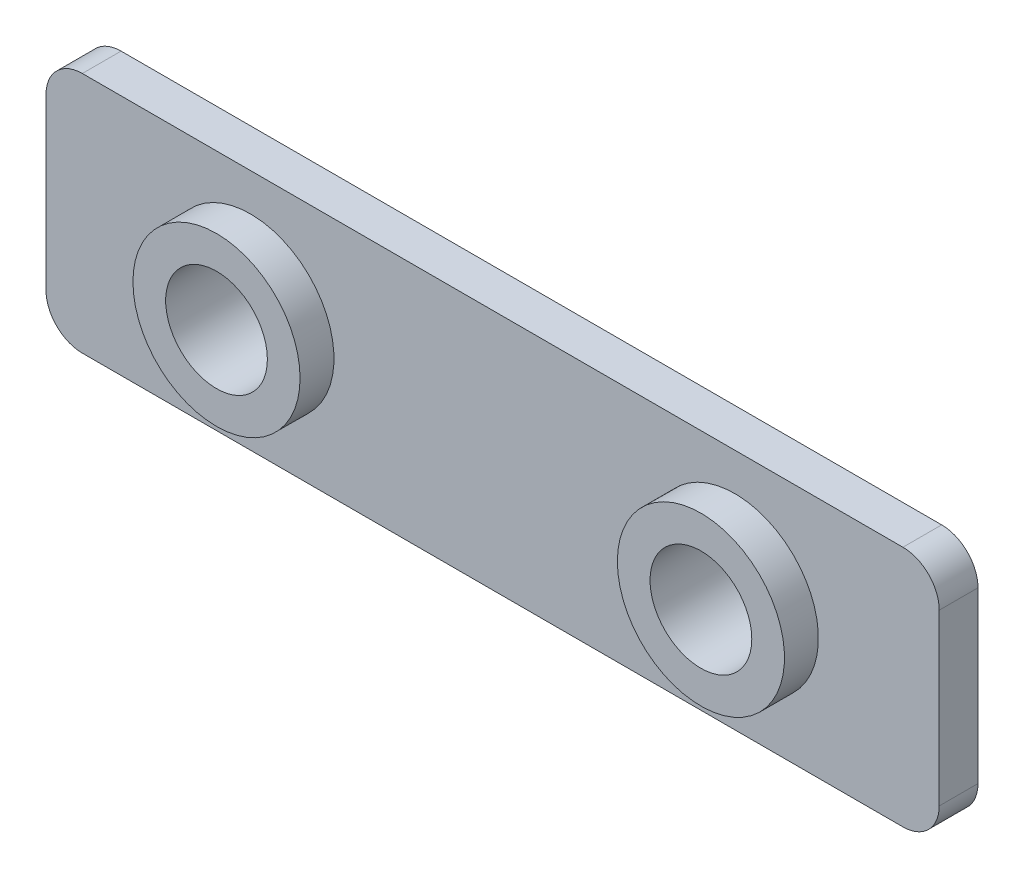
ISO-10303-21;
HEADER;
FILE_DESCRIPTION(('STEP AP214'),'2;1');
FILE_NAME('part.step','',(''),(''),'','','');
FILE_SCHEMA(('AUTOMOTIVE_DESIGN { 1 0 10303 214 1 1 1 1 }'));
ENDSEC;
DATA;
#1=APPLICATION_CONTEXT('core data for automotive mechanical design processes');
#2=APPLICATION_PROTOCOL_DEFINITION('international standard','automotive_design',2000,#1);
#3=PRODUCT_CONTEXT('',#1,'mechanical');
#4=PRODUCT('Part','Part','',(#3));
#5=PRODUCT_RELATED_PRODUCT_CATEGORY('part','',(#4));
#6=PRODUCT_DEFINITION_FORMATION('','',#4);
#7=PRODUCT_DEFINITION_CONTEXT('part definition',#1,'design');
#8=PRODUCT_DEFINITION('design','',#6,#7);
#9=PRODUCT_DEFINITION_SHAPE('','',#8);
#10=(LENGTH_UNIT() NAMED_UNIT(*) SI_UNIT(.MILLI.,.METRE.));
#11=(NAMED_UNIT(*) PLANE_ANGLE_UNIT() SI_UNIT($,.RADIAN.));
#12=(NAMED_UNIT(*) SI_UNIT($,.STERADIAN.) SOLID_ANGLE_UNIT());
#13=UNCERTAINTY_MEASURE_WITH_UNIT(LENGTH_MEASURE(1.E-05),#10,'distance_accuracy_value','');
#14=(GEOMETRIC_REPRESENTATION_CONTEXT(3) GLOBAL_UNCERTAINTY_ASSIGNED_CONTEXT((#13)) GLOBAL_UNIT_ASSIGNED_CONTEXT((#10,
#11,#12)) REPRESENTATION_CONTEXT('',''));
#15=CARTESIAN_POINT('',(0.,0.,0.));
#16=DIRECTION('',(0.,0.,1.));
#17=DIRECTION('',(1.,0.,0.));
#18=AXIS2_PLACEMENT_3D('',#15,#16,#17);
#19=CARTESIAN_POINT('',(35.38,8.5,1.6));
#20=DIRECTION('',(0.,0.,-1.));
#21=DIRECTION('',(-1.,0.,0.));
#22=AXIS2_PLACEMENT_3D('',#19,#20,#21);
#23=PLANE('',#22);
#24=CARTESIAN_POINT('',(8.44,5.,1.6));
#25=DIRECTION('',(0.,0.,-1.));
#26=DIRECTION('',(-1.,0.,0.));
#27=AXIS2_PLACEMENT_3D('',#24,#25,#26);
#28=CIRCLE('',#27,3.45);
#29=CARTESIAN_POINT('',(4.99,5.,1.6));
#30=VERTEX_POINT('',#29);
#31=EDGE_CURVE('E44',#30,#30,#28,.F.);
#32=ORIENTED_EDGE('',*,*,#31,.F.);
#33=EDGE_LOOP('',(#32));
#34=FACE_BOUND('',#33,.T.);
#35=CARTESIAN_POINT('',(35.38,8.5,1.6));
#36=DIRECTION('',(0.,0.,1.));
#37=DIRECTION('',(-1.,0.,0.));
#38=AXIS2_PLACEMENT_3D('',#35,#36,#37);
#39=CIRCLE('',#38,1.5);
#40=CARTESIAN_POINT('',(36.88,8.49999999999999,1.6));
#41=VERTEX_POINT('',#40);
#42=CARTESIAN_POINT('',(35.38,10.,1.6));
#43=VERTEX_POINT('',#42);
#44=EDGE_CURVE('E148',#41,#43,#39,.T.);
#45=ORIENTED_EDGE('',*,*,#44,.T.);
#46=DIRECTION('',(-1.,0.,0.));
#47=VECTOR('',#46,1.);
#48=CARTESIAN_POINT('',(1.50000000000001,10.,1.6));
#49=LINE('',#48,#47);
#50=CARTESIAN_POINT('',(1.50000000000001,10.,1.6));
#51=VERTEX_POINT('',#50);
#52=EDGE_CURVE('E96',#43,#51,#49,.T.);
#53=ORIENTED_EDGE('',*,*,#52,.T.);
#54=CARTESIAN_POINT('',(1.5,8.5,1.6));
#55=DIRECTION('',(0.,0.,1.));
#56=DIRECTION('',(-1.,0.,0.));
#57=AXIS2_PLACEMENT_3D('',#54,#55,#56);
#58=CIRCLE('',#57,1.5);
#59=CARTESIAN_POINT('',(0.,8.49999999999999,1.6));
#60=VERTEX_POINT('',#59);
#61=EDGE_CURVE('E208',#51,#60,#58,.T.);
#62=ORIENTED_EDGE('',*,*,#61,.T.);
#63=DIRECTION('',(0.,-1.,0.));
#64=VECTOR('',#63,1.);
#65=CARTESIAN_POINT('',(0.,1.50000000000001,1.6));
#66=LINE('',#65,#64);
#67=CARTESIAN_POINT('',(0.,1.50000000000001,1.6));
#68=VERTEX_POINT('',#67);
#69=EDGE_CURVE('E213',#60,#68,#66,.T.);
#70=ORIENTED_EDGE('',*,*,#69,.T.);
#71=CARTESIAN_POINT('',(1.5,1.5,1.6));
#72=DIRECTION('',(0.,0.,1.));
#73=DIRECTION('',(-1.,0.,0.));
#74=AXIS2_PLACEMENT_3D('',#71,#72,#73);
#75=CIRCLE('',#74,1.5);
#76=CARTESIAN_POINT('',(1.50000000000001,0.,1.6));
#77=VERTEX_POINT('',#76);
#78=EDGE_CURVE('E115',#68,#77,#75,.T.);
#79=ORIENTED_EDGE('',*,*,#78,.T.);
#80=DIRECTION('',(1.,0.,0.));
#81=VECTOR('',#80,1.);
#82=CARTESIAN_POINT('',(1.50000000000001,0.,1.6));
#83=LINE('',#82,#81);
#84=CARTESIAN_POINT('',(35.38,0.,1.6));
#85=VERTEX_POINT('',#84);
#86=EDGE_CURVE('E109',#77,#85,#83,.T.);
#87=ORIENTED_EDGE('',*,*,#86,.T.);
#88=CARTESIAN_POINT('',(35.38,1.5,1.6));
#89=DIRECTION('',(0.,0.,1.));
#90=DIRECTION('',(1.,0.,0.));
#91=AXIS2_PLACEMENT_3D('',#88,#89,#90);
#92=CIRCLE('',#91,1.5);
#93=CARTESIAN_POINT('',(36.88,1.50000000000001,1.6));
#94=VERTEX_POINT('',#93);
#95=EDGE_CURVE('E113',#85,#94,#92,.T.);
#96=ORIENTED_EDGE('',*,*,#95,.T.);
#97=DIRECTION('',(0.,1.,0.));
#98=VECTOR('',#97,1.);
#99=CARTESIAN_POINT('',(36.88,1.50000000000001,1.6));
#100=LINE('',#99,#98);
#101=EDGE_CURVE('E52',#94,#41,#100,.T.);
#102=ORIENTED_EDGE('',*,*,#101,.T.);
#103=EDGE_LOOP('',(#45,#53,#62,#70,#79,#87,#96,#102));
#104=FACE_BOUND('',#103,.T.);
#105=CARTESIAN_POINT('',(28.44,5.,1.6));
#106=DIRECTION('',(0.,0.,-1.));
#107=DIRECTION('',(-1.,0.,0.));
#108=AXIS2_PLACEMENT_3D('',#105,#106,#107);
#109=CIRCLE('',#108,3.45);
#110=CARTESIAN_POINT('',(24.99,5.,1.6));
#111=VERTEX_POINT('',#110);
#112=EDGE_CURVE('E11',#111,#111,#109,.F.);
#113=ORIENTED_EDGE('',*,*,#112,.F.);
#114=EDGE_LOOP('',(#113));
#115=FACE_BOUND('',#114,.T.);
#116=ADVANCED_FACE('F35',(#34,#104,#115),#23,.F.);
#117=CARTESIAN_POINT('',(35.38,8.5,1.6));
#118=DIRECTION('',(0.,0.,-1.));
#119=DIRECTION('',(-1.,0.,0.));
#120=AXIS2_PLACEMENT_3D('',#117,#118,#119);
#121=CYLINDRICAL_SURFACE('',#120,1.5);
#122=CARTESIAN_POINT('',(35.38,8.5,0.));
#123=DIRECTION('',(0.,0.,1.));
#124=DIRECTION('',(-1.,0.,0.));
#125=AXIS2_PLACEMENT_3D('',#122,#123,#124);
#126=CIRCLE('',#125,1.5);
#127=CARTESIAN_POINT('',(36.88,8.49999999999999,0.));
#128=VERTEX_POINT('',#127);
#129=CARTESIAN_POINT('',(35.38,10.,0.));
#130=VERTEX_POINT('',#129);
#131=EDGE_CURVE('E133',#128,#130,#126,.T.);
#132=ORIENTED_EDGE('',*,*,#131,.T.);
#133=DIRECTION('',(0.,0.,-1.));
#134=VECTOR('',#133,1.);
#135=CARTESIAN_POINT('',(35.38,10.,1.6));
#136=LINE('',#135,#134);
#137=EDGE_CURVE('E161',#43,#130,#136,.T.);
#138=ORIENTED_EDGE('',*,*,#137,.F.);
#139=ORIENTED_EDGE('',*,*,#44,.F.);
#140=DIRECTION('',(0.,0.,-1.));
#141=VECTOR('',#140,1.);
#142=CARTESIAN_POINT('',(36.88,8.49999999999999,1.6));
#143=LINE('',#142,#141);
#144=EDGE_CURVE('E129',#41,#128,#143,.T.);
#145=ORIENTED_EDGE('',*,*,#144,.T.);
#146=EDGE_LOOP('',(#132,#138,#139,#145));
#147=FACE_BOUND('',#146,.T.);
#148=ADVANCED_FACE('F37',(#147),#121,.T.);
#149=CARTESIAN_POINT('',(1.50000000000001,10.,1.6));
#150=DIRECTION('',(0.,-1.,0.));
#151=DIRECTION('',(0.,0.,-1.));
#152=AXIS2_PLACEMENT_3D('',#149,#150,#151);
#153=PLANE('',#152);
#154=DIRECTION('',(-1.,0.,0.));
#155=VECTOR('',#154,1.);
#156=CARTESIAN_POINT('',(1.50000000000001,10.,0.));
#157=LINE('',#156,#155);
#158=CARTESIAN_POINT('',(1.50000000000001,10.,0.));
#159=VERTEX_POINT('',#158);
#160=EDGE_CURVE('E136',#130,#159,#157,.T.);
#161=ORIENTED_EDGE('',*,*,#160,.T.);
#162=DIRECTION('',(0.,0.,-1.));
#163=VECTOR('',#162,1.);
#164=CARTESIAN_POINT('',(1.50000000000001,10.,1.6));
#165=LINE('',#164,#163);
#166=EDGE_CURVE('E158',#51,#159,#165,.T.);
#167=ORIENTED_EDGE('',*,*,#166,.F.);
#168=ORIENTED_EDGE('',*,*,#52,.F.);
#169=ORIENTED_EDGE('',*,*,#137,.T.);
#170=EDGE_LOOP('',(#161,#167,#168,#169));
#171=FACE_BOUND('',#170,.T.);
#172=ADVANCED_FACE('F172',(#171),#153,.F.);
#173=CARTESIAN_POINT('',(1.5,8.5,1.6));
#174=DIRECTION('',(0.,0.,-1.));
#175=DIRECTION('',(-1.,0.,0.));
#176=AXIS2_PLACEMENT_3D('',#173,#174,#175);
#177=CYLINDRICAL_SURFACE('',#176,1.5);
#178=CARTESIAN_POINT('',(1.5,8.5,0.));
#179=DIRECTION('',(0.,0.,1.));
#180=DIRECTION('',(-1.,0.,0.));
#181=AXIS2_PLACEMENT_3D('',#178,#179,#180);
#182=CIRCLE('',#181,1.5);
#183=CARTESIAN_POINT('',(0.,8.49999999999999,0.));
#184=VERTEX_POINT('',#183);
#185=EDGE_CURVE('E139',#159,#184,#182,.T.);
#186=ORIENTED_EDGE('',*,*,#185,.T.);
#187=DIRECTION('',(0.,0.,-1.));
#188=VECTOR('',#187,1.);
#189=CARTESIAN_POINT('',(0.,8.49999999999999,1.6));
#190=LINE('',#189,#188);
#191=EDGE_CURVE('E155',#60,#184,#190,.T.);
#192=ORIENTED_EDGE('',*,*,#191,.F.);
#193=ORIENTED_EDGE('',*,*,#61,.F.);
#194=ORIENTED_EDGE('',*,*,#166,.T.);
#195=EDGE_LOOP('',(#186,#192,#193,#194));
#196=FACE_BOUND('',#195,.T.);
#197=ADVANCED_FACE('F195',(#196),#177,.T.);
#198=CARTESIAN_POINT('',(0.,1.50000000000001,1.6));
#199=DIRECTION('',(1.,0.,0.));
#200=DIRECTION('',(0.,0.,-1.));
#201=AXIS2_PLACEMENT_3D('',#198,#199,#200);
#202=PLANE('',#201);
#203=DIRECTION('',(0.,-1.,0.));
#204=VECTOR('',#203,1.);
#205=CARTESIAN_POINT('',(0.,1.50000000000001,0.));
#206=LINE('',#205,#204);
#207=CARTESIAN_POINT('',(0.,1.50000000000001,0.));
#208=VERTEX_POINT('',#207);
#209=EDGE_CURVE('E141',#184,#208,#206,.T.);
#210=ORIENTED_EDGE('',*,*,#209,.T.);
#211=DIRECTION('',(0.,0.,-1.));
#212=VECTOR('',#211,1.);
#213=CARTESIAN_POINT('',(0.,1.50000000000001,1.6));
#214=LINE('',#213,#212);
#215=EDGE_CURVE('E152',#68,#208,#214,.T.);
#216=ORIENTED_EDGE('',*,*,#215,.F.);
#217=ORIENTED_EDGE('',*,*,#69,.F.);
#218=ORIENTED_EDGE('',*,*,#191,.T.);
#219=EDGE_LOOP('',(#210,#216,#217,#218));
#220=FACE_BOUND('',#219,.T.);
#221=ADVANCED_FACE('F191',(#220),#202,.F.);
#222=CARTESIAN_POINT('',(1.5,1.5,1.6));
#223=DIRECTION('',(0.,0.,-1.));
#224=DIRECTION('',(-1.,0.,0.));
#225=AXIS2_PLACEMENT_3D('',#222,#223,#224);
#226=CYLINDRICAL_SURFACE('',#225,1.5);
#227=CARTESIAN_POINT('',(1.5,1.5,0.));
#228=DIRECTION('',(0.,0.,1.));
#229=DIRECTION('',(-1.,0.,0.));
#230=AXIS2_PLACEMENT_3D('',#227,#228,#229);
#231=CIRCLE('',#230,1.5);
#232=CARTESIAN_POINT('',(1.50000000000001,0.,0.));
#233=VERTEX_POINT('',#232);
#234=EDGE_CURVE('E143',#208,#233,#231,.T.);
#235=ORIENTED_EDGE('',*,*,#234,.T.);
#236=DIRECTION('',(0.,0.,-1.));
#237=VECTOR('',#236,1.);
#238=CARTESIAN_POINT('',(1.50000000000001,0.,1.6));
#239=LINE('',#238,#237);
#240=EDGE_CURVE('E124',#77,#233,#239,.T.);
#241=ORIENTED_EDGE('',*,*,#240,.F.);
#242=ORIENTED_EDGE('',*,*,#78,.F.);
#243=ORIENTED_EDGE('',*,*,#215,.T.);
#244=EDGE_LOOP('',(#235,#241,#242,#243));
#245=FACE_BOUND('',#244,.T.);
#246=ADVANCED_FACE('F188',(#245),#226,.T.);
#247=CARTESIAN_POINT('',(1.50000000000001,0.,1.6));
#248=DIRECTION('',(0.,1.,0.));
#249=DIRECTION('',(0.,0.,1.));
#250=AXIS2_PLACEMENT_3D('',#247,#248,#249);
#251=PLANE('',#250);
#252=DIRECTION('',(1.,0.,0.));
#253=VECTOR('',#252,1.);
#254=CARTESIAN_POINT('',(1.50000000000001,0.,0.));
#255=LINE('',#254,#253);
#256=CARTESIAN_POINT('',(35.38,0.,0.));
#257=VERTEX_POINT('',#256);
#258=EDGE_CURVE('E123',#233,#257,#255,.T.);
#259=ORIENTED_EDGE('',*,*,#258,.T.);
#260=DIRECTION('',(0.,0.,-1.));
#261=VECTOR('',#260,1.);
#262=CARTESIAN_POINT('',(35.38,0.,1.6));
#263=LINE('',#262,#261);
#264=EDGE_CURVE('E120',#85,#257,#263,.T.);
#265=ORIENTED_EDGE('',*,*,#264,.F.);
#266=ORIENTED_EDGE('',*,*,#86,.F.);
#267=ORIENTED_EDGE('',*,*,#240,.T.);
#268=EDGE_LOOP('',(#259,#265,#266,#267));
#269=FACE_BOUND('',#268,.T.);
#270=ADVANCED_FACE('F121',(#269),#251,.F.);
#271=CARTESIAN_POINT('',(35.38,1.5,1.6));
#272=DIRECTION('',(0.,0.,-1.));
#273=DIRECTION('',(-1.,0.,0.));
#274=AXIS2_PLACEMENT_3D('',#271,#272,#273);
#275=CYLINDRICAL_SURFACE('',#274,1.5);
#276=CARTESIAN_POINT('',(35.38,1.5,0.));
#277=DIRECTION('',(0.,0.,1.));
#278=DIRECTION('',(1.,0.,0.));
#279=AXIS2_PLACEMENT_3D('',#276,#277,#278);
#280=CIRCLE('',#279,1.5);
#281=CARTESIAN_POINT('',(36.88,1.50000000000001,0.));
#282=VERTEX_POINT('',#281);
#283=EDGE_CURVE('E81',#257,#282,#280,.T.);
#284=ORIENTED_EDGE('',*,*,#283,.T.);
#285=DIRECTION('',(0.,0.,-1.));
#286=VECTOR('',#285,1.);
#287=CARTESIAN_POINT('',(36.88,1.50000000000001,1.6));
#288=LINE('',#287,#286);
#289=EDGE_CURVE('E125',#94,#282,#288,.T.);
#290=ORIENTED_EDGE('',*,*,#289,.F.);
#291=ORIENTED_EDGE('',*,*,#95,.F.);
#292=ORIENTED_EDGE('',*,*,#264,.T.);
#293=EDGE_LOOP('',(#284,#290,#291,#292));
#294=FACE_BOUND('',#293,.T.);
#295=ADVANCED_FACE('F127',(#294),#275,.T.);
#296=CARTESIAN_POINT('',(36.88,1.50000000000001,1.6));
#297=DIRECTION('',(-1.,0.,0.));
#298=DIRECTION('',(0.,0.,1.));
#299=AXIS2_PLACEMENT_3D('',#296,#297,#298);
#300=PLANE('',#299);
#301=DIRECTION('',(0.,1.,0.));
#302=VECTOR('',#301,1.);
#303=CARTESIAN_POINT('',(36.88,1.50000000000001,0.));
#304=LINE('',#303,#302);
#305=EDGE_CURVE('E87',#282,#128,#304,.T.);
#306=ORIENTED_EDGE('',*,*,#305,.T.);
#307=ORIENTED_EDGE('',*,*,#144,.F.);
#308=ORIENTED_EDGE('',*,*,#101,.F.);
#309=ORIENTED_EDGE('',*,*,#289,.T.);
#310=EDGE_LOOP('',(#306,#307,#308,#309));
#311=FACE_BOUND('',#310,.T.);
#312=ADVANCED_FACE('F180',(#311),#300,.F.);
#313=CARTESIAN_POINT('',(35.38,8.5,0.));
#314=DIRECTION('',(0.,0.,-1.));
#315=DIRECTION('',(-1.,0.,0.));
#316=AXIS2_PLACEMENT_3D('',#313,#314,#315);
#317=PLANE('',#316);
#318=CARTESIAN_POINT('',(8.44,5.,0.));
#319=DIRECTION('',(0.,0.,1.));
#320=DIRECTION('',(1.,0.,0.));
#321=AXIS2_PLACEMENT_3D('',#318,#319,#320);
#322=CIRCLE('',#321,2.1);
#323=CARTESIAN_POINT('',(10.54,5.,0.));
#324=VERTEX_POINT('',#323);
#325=EDGE_CURVE('E230',#324,#324,#322,.T.);
#326=ORIENTED_EDGE('',*,*,#325,.T.);
#327=EDGE_LOOP('',(#326));
#328=FACE_BOUND('',#327,.T.);
#329=CARTESIAN_POINT('',(28.44,5.,0.));
#330=DIRECTION('',(0.,0.,1.));
#331=DIRECTION('',(1.,0.,0.));
#332=AXIS2_PLACEMENT_3D('',#329,#330,#331);
#333=CIRCLE('',#332,2.1);
#334=CARTESIAN_POINT('',(30.54,5.,0.));
#335=VERTEX_POINT('',#334);
#336=EDGE_CURVE('E224',#335,#335,#333,.T.);
#337=ORIENTED_EDGE('',*,*,#336,.T.);
#338=EDGE_LOOP('',(#337));
#339=FACE_BOUND('',#338,.T.);
#340=ORIENTED_EDGE('',*,*,#131,.F.);
#341=ORIENTED_EDGE('',*,*,#305,.F.);
#342=ORIENTED_EDGE('',*,*,#283,.F.);
#343=ORIENTED_EDGE('',*,*,#258,.F.);
#344=ORIENTED_EDGE('',*,*,#234,.F.);
#345=ORIENTED_EDGE('',*,*,#209,.F.);
#346=ORIENTED_EDGE('',*,*,#185,.F.);
#347=ORIENTED_EDGE('',*,*,#160,.F.);
#348=EDGE_LOOP('',(#340,#341,#342,#343,#344,#345,#346,#347));
#349=FACE_BOUND('',#348,.T.);
#350=ADVANCED_FACE('F177',(#328,#339,#349),#317,.T.);
#351=CARTESIAN_POINT('',(8.44,5.,3.));
#352=DIRECTION('',(0.,0.,-1.));
#353=DIRECTION('',(-1.,0.,0.));
#354=AXIS2_PLACEMENT_3D('',#351,#352,#353);
#355=CYLINDRICAL_SURFACE('',#354,3.45);
#356=CARTESIAN_POINT('',(8.44,5.,3.));
#357=DIRECTION('',(0.,0.,1.));
#358=DIRECTION('',(1.,0.,0.));
#359=AXIS2_PLACEMENT_3D('',#356,#357,#358);
#360=CIRCLE('',#359,3.45);
#361=CARTESIAN_POINT('',(11.89,5.,3.));
#362=VERTEX_POINT('',#361);
#363=EDGE_CURVE('E137',#362,#362,#360,.T.);
#364=ORIENTED_EDGE('',*,*,#363,.F.);
#365=EDGE_LOOP('',(#364));
#366=FACE_BOUND('',#365,.T.);
#367=ORIENTED_EDGE('',*,*,#31,.T.);
#368=EDGE_LOOP('',(#367));
#369=FACE_BOUND('',#368,.T.);
#370=ADVANCED_FACE('F165',(#366,#369),#355,.T.);
#371=CARTESIAN_POINT('',(8.44,5.,3.));
#372=DIRECTION('',(0.,0.,1.));
#373=DIRECTION('',(1.,0.,0.));
#374=AXIS2_PLACEMENT_3D('',#371,#372,#373);
#375=PLANE('',#374);
#376=CARTESIAN_POINT('',(8.44,5.,3.));
#377=DIRECTION('',(0.,0.,1.));
#378=DIRECTION('',(1.,0.,0.));
#379=AXIS2_PLACEMENT_3D('',#376,#377,#378);
#380=CIRCLE('',#379,2.09999999999999);
#381=CARTESIAN_POINT('',(10.54,5.,3.));
#382=VERTEX_POINT('',#381);
#383=EDGE_CURVE('E233',#382,#382,#380,.T.);
#384=ORIENTED_EDGE('',*,*,#383,.F.);
#385=EDGE_LOOP('',(#384));
#386=FACE_BOUND('',#385,.T.);
#387=ORIENTED_EDGE('',*,*,#363,.T.);
#388=EDGE_LOOP('',(#387));
#389=FACE_BOUND('',#388,.T.);
#390=ADVANCED_FACE('F239',(#386,#389),#375,.T.);
#391=CARTESIAN_POINT('',(28.44,5.,3.));
#392=DIRECTION('',(0.,0.,-1.));
#393=DIRECTION('',(-1.,0.,0.));
#394=AXIS2_PLACEMENT_3D('',#391,#392,#393);
#395=CYLINDRICAL_SURFACE('',#394,3.45);
#396=CARTESIAN_POINT('',(28.44,5.,3.));
#397=DIRECTION('',(0.,0.,1.));
#398=DIRECTION('',(-1.,0.,0.));
#399=AXIS2_PLACEMENT_3D('',#396,#397,#398);
#400=CIRCLE('',#399,3.45);
#401=CARTESIAN_POINT('',(24.99,5.,3.));
#402=VERTEX_POINT('',#401);
#403=EDGE_CURVE('E221',#402,#402,#400,.T.);
#404=ORIENTED_EDGE('',*,*,#403,.F.);
#405=EDGE_LOOP('',(#404));
#406=FACE_BOUND('',#405,.T.);
#407=ORIENTED_EDGE('',*,*,#112,.T.);
#408=EDGE_LOOP('',(#407));
#409=FACE_BOUND('',#408,.T.);
#410=ADVANCED_FACE('F242',(#406,#409),#395,.T.);
#411=CARTESIAN_POINT('',(28.44,5.,3.));
#412=DIRECTION('',(0.,0.,-1.));
#413=DIRECTION('',(-1.,0.,0.));
#414=AXIS2_PLACEMENT_3D('',#411,#412,#413);
#415=PLANE('',#414);
#416=CARTESIAN_POINT('',(28.44,5.,3.));
#417=DIRECTION('',(0.,0.,1.));
#418=DIRECTION('',(1.,0.,0.));
#419=AXIS2_PLACEMENT_3D('',#416,#417,#418);
#420=CIRCLE('',#419,2.09999999999999);
#421=CARTESIAN_POINT('',(30.54,5.,3.));
#422=VERTEX_POINT('',#421);
#423=EDGE_CURVE('E227',#422,#422,#420,.T.);
#424=ORIENTED_EDGE('',*,*,#423,.F.);
#425=EDGE_LOOP('',(#424));
#426=FACE_BOUND('',#425,.T.);
#427=ORIENTED_EDGE('',*,*,#403,.T.);
#428=EDGE_LOOP('',(#427));
#429=FACE_BOUND('',#428,.T.);
#430=ADVANCED_FACE('F261',(#426,#429),#415,.F.);
#431=CARTESIAN_POINT('',(28.44,5.,3.));
#432=DIRECTION('',(0.,0.,1.));
#433=DIRECTION('',(1.,0.,0.));
#434=AXIS2_PLACEMENT_3D('',#431,#432,#433);
#435=CYLINDRICAL_SURFACE('',#434,2.09999999999999);
#436=ORIENTED_EDGE('',*,*,#336,.F.);
#437=EDGE_LOOP('',(#436));
#438=FACE_BOUND('',#437,.T.);
#439=ORIENTED_EDGE('',*,*,#423,.T.);
#440=EDGE_LOOP('',(#439));
#441=FACE_BOUND('',#440,.T.);
#442=ADVANCED_FACE('F268',(#438,#441),#435,.F.);
#443=CARTESIAN_POINT('',(8.44,5.,3.));
#444=DIRECTION('',(0.,0.,1.));
#445=DIRECTION('',(1.,0.,0.));
#446=AXIS2_PLACEMENT_3D('',#443,#444,#445);
#447=CYLINDRICAL_SURFACE('',#446,2.09999999999999);
#448=ORIENTED_EDGE('',*,*,#325,.F.);
#449=EDGE_LOOP('',(#448));
#450=FACE_BOUND('',#449,.T.);
#451=ORIENTED_EDGE('',*,*,#383,.T.);
#452=EDGE_LOOP('',(#451));
#453=FACE_BOUND('',#452,.T.);
#454=ADVANCED_FACE('F237',(#450,#453),#447,.F.);
#455=CLOSED_SHELL('',(#116,#148,#172,#197,#221,#246,#270,#295,#312,#350,#370,#390,#410,#430,
#442,#454));
#456=MANIFOLD_SOLID_BREP('B2',#455);
#457=ADVANCED_BREP_SHAPE_REPRESENTATION('',(#18,#456),#14);
#458=SHAPE_DEFINITION_REPRESENTATION(#9,#457);
ENDSEC;
END-ISO-10303-21;
